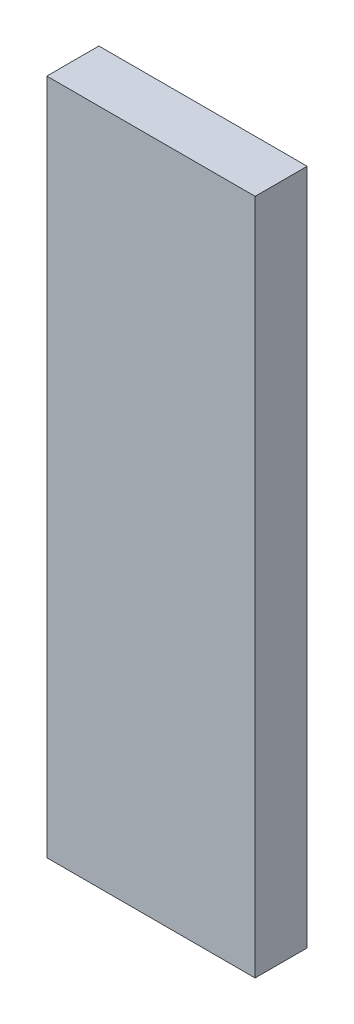
ISO-10303-21;
HEADER;
FILE_DESCRIPTION(('STEP AP214'),'2;1');
FILE_NAME('part.step','',(''),(''),'','','');
FILE_SCHEMA(('AUTOMOTIVE_DESIGN { 1 0 10303 214 1 1 1 1 }'));
ENDSEC;
DATA;
#1=APPLICATION_CONTEXT('core data for automotive mechanical design processes');
#2=APPLICATION_PROTOCOL_DEFINITION('international standard','automotive_design',2000,#1);
#3=PRODUCT_CONTEXT('',#1,'mechanical');
#4=PRODUCT('Part','Part','',(#3));
#5=PRODUCT_RELATED_PRODUCT_CATEGORY('part','',(#4));
#6=PRODUCT_DEFINITION_FORMATION('','',#4);
#7=PRODUCT_DEFINITION_CONTEXT('part definition',#1,'design');
#8=PRODUCT_DEFINITION('design','',#6,#7);
#9=PRODUCT_DEFINITION_SHAPE('','',#8);
#10=(LENGTH_UNIT() NAMED_UNIT(*) SI_UNIT(.MILLI.,.METRE.));
#11=(NAMED_UNIT(*) PLANE_ANGLE_UNIT() SI_UNIT($,.RADIAN.));
#12=(NAMED_UNIT(*) SI_UNIT($,.STERADIAN.) SOLID_ANGLE_UNIT());
#13=UNCERTAINTY_MEASURE_WITH_UNIT(LENGTH_MEASURE(1.E-05),#10,'distance_accuracy_value','');
#14=(GEOMETRIC_REPRESENTATION_CONTEXT(3) GLOBAL_UNCERTAINTY_ASSIGNED_CONTEXT((#13)) GLOBAL_UNIT_ASSIGNED_CONTEXT((#10,
#11,#12)) REPRESENTATION_CONTEXT('',''));
#15=CARTESIAN_POINT('',(0.,0.,0.));
#16=DIRECTION('',(0.,0.,1.));
#17=DIRECTION('',(1.,0.,0.));
#18=AXIS2_PLACEMENT_3D('',#15,#16,#17);
#19=CARTESIAN_POINT('',(-0.1999996,-0.6499987,0.1));
#20=DIRECTION('',(0.,0.,1.));
#21=DIRECTION('',(1.,0.,0.));
#22=AXIS2_PLACEMENT_3D('',#19,#20,#21);
#23=PLANE('',#22);
#24=DIRECTION('',(1.,0.,0.));
#25=VECTOR('',#24,1.);
#26=CARTESIAN_POINT('',(-0.1999996,0.65000124,0.1));
#27=LINE('',#26,#25);
#28=CARTESIAN_POINT('',(-0.1999996,0.65000124,0.1));
#29=VERTEX_POINT('',#28);
#30=CARTESIAN_POINT('',(0.20000214,0.65000124,0.1));
#31=VERTEX_POINT('',#30);
#32=EDGE_CURVE('E52',#29,#31,#27,.T.);
#33=ORIENTED_EDGE('',*,*,#32,.F.);
#34=DIRECTION('',(0.,1.,0.));
#35=VECTOR('',#34,1.);
#36=CARTESIAN_POINT('',(-0.1999996,-0.6499987,0.1));
#37=LINE('',#36,#35);
#38=CARTESIAN_POINT('',(-0.1999996,-0.6499987,0.1));
#39=VERTEX_POINT('',#38);
#40=EDGE_CURVE('E67',#39,#29,#37,.T.);
#41=ORIENTED_EDGE('',*,*,#40,.F.);
#42=DIRECTION('',(1.,0.,0.));
#43=VECTOR('',#42,1.);
#44=CARTESIAN_POINT('',(0.20000214,-0.6499987,0.1));
#45=LINE('',#44,#43);
#46=CARTESIAN_POINT('',(0.20000214,-0.6499987,0.1));
#47=VERTEX_POINT('',#46);
#48=EDGE_CURVE('E19',#47,#39,#45,.F.);
#49=ORIENTED_EDGE('',*,*,#48,.F.);
#50=DIRECTION('',(0.,1.,0.));
#51=VECTOR('',#50,1.);
#52=CARTESIAN_POINT('',(0.20000214,0.65000124,0.1));
#53=LINE('',#52,#51);
#54=EDGE_CURVE('E57',#31,#47,#53,.F.);
#55=ORIENTED_EDGE('',*,*,#54,.F.);
#56=EDGE_LOOP('',(#33,#41,#49,#55));
#57=FACE_BOUND('',#56,.T.);
#58=ADVANCED_FACE('F16',(#57),#23,.T.);
#59=CARTESIAN_POINT('',(0.20000214,-0.6499987,0.));
#60=DIRECTION('',(0.,-1.,0.));
#61=DIRECTION('',(0.,0.,-1.));
#62=AXIS2_PLACEMENT_3D('',#59,#60,#61);
#63=PLANE('',#62);
#64=DIRECTION('',(0.,0.,1.));
#65=VECTOR('',#64,1.);
#66=CARTESIAN_POINT('',(-0.1999996,-0.6499987,0.));
#67=LINE('',#66,#65);
#68=CARTESIAN_POINT('',(-0.1999996,-0.6499987,0.));
#69=VERTEX_POINT('',#68);
#70=EDGE_CURVE('E78',#69,#39,#67,.T.);
#71=ORIENTED_EDGE('',*,*,#70,.F.);
#72=DIRECTION('',(1.,0.,0.));
#73=VECTOR('',#72,1.);
#74=CARTESIAN_POINT('',(-0.1999996,-0.6499987,0.));
#75=LINE('',#74,#73);
#76=CARTESIAN_POINT('',(0.20000214,-0.6499987,0.));
#77=VERTEX_POINT('',#76);
#78=EDGE_CURVE('E73',#69,#77,#75,.T.);
#79=ORIENTED_EDGE('',*,*,#78,.T.);
#80=DIRECTION('',(0.,0.,-1.));
#81=VECTOR('',#80,1.);
#82=CARTESIAN_POINT('',(0.20000214,-0.6499987,0.));
#83=LINE('',#82,#81);
#84=EDGE_CURVE('E62',#47,#77,#83,.T.);
#85=ORIENTED_EDGE('',*,*,#84,.F.);
#86=ORIENTED_EDGE('',*,*,#48,.T.);
#87=EDGE_LOOP('',(#71,#79,#85,#86));
#88=FACE_BOUND('',#87,.T.);
#89=ADVANCED_FACE('F72',(#88),#63,.T.);
#90=CARTESIAN_POINT('',(0.20000214,0.65000124,0.));
#91=DIRECTION('',(1.,0.,0.));
#92=DIRECTION('',(0.,0.,-1.));
#93=AXIS2_PLACEMENT_3D('',#90,#91,#92);
#94=PLANE('',#93);
#95=ORIENTED_EDGE('',*,*,#84,.T.);
#96=DIRECTION('',(0.,1.,0.));
#97=VECTOR('',#96,1.);
#98=CARTESIAN_POINT('',(0.20000214,-0.6499987,0.));
#99=LINE('',#98,#97);
#100=CARTESIAN_POINT('',(0.20000214,0.65000124,0.));
#101=VERTEX_POINT('',#100);
#102=EDGE_CURVE('E83',#77,#101,#99,.T.);
#103=ORIENTED_EDGE('',*,*,#102,.T.);
#104=DIRECTION('',(0.,0.,1.));
#105=VECTOR('',#104,1.);
#106=CARTESIAN_POINT('',(0.20000214,0.65000124,0.));
#107=LINE('',#106,#105);
#108=EDGE_CURVE('E64',#31,#101,#107,.F.);
#109=ORIENTED_EDGE('',*,*,#108,.F.);
#110=ORIENTED_EDGE('',*,*,#54,.T.);
#111=EDGE_LOOP('',(#95,#103,#109,#110));
#112=FACE_BOUND('',#111,.T.);
#113=ADVANCED_FACE('F59',(#112),#94,.T.);
#114=CARTESIAN_POINT('',(-0.1999996,0.65000124,0.));
#115=DIRECTION('',(0.,1.,0.));
#116=DIRECTION('',(0.,0.,1.));
#117=AXIS2_PLACEMENT_3D('',#114,#115,#116);
#118=PLANE('',#117);
#119=ORIENTED_EDGE('',*,*,#108,.T.);
#120=DIRECTION('',(1.,0.,0.));
#121=VECTOR('',#120,1.);
#122=CARTESIAN_POINT('',(-0.1999996,0.65000124,0.));
#123=LINE('',#122,#121);
#124=CARTESIAN_POINT('',(-0.1999996,0.65000124,0.));
#125=VERTEX_POINT('',#124);
#126=EDGE_CURVE('E25',#101,#125,#123,.F.);
#127=ORIENTED_EDGE('',*,*,#126,.T.);
#128=DIRECTION('',(0.,0.,1.));
#129=VECTOR('',#128,1.);
#130=CARTESIAN_POINT('',(-0.1999996,0.65000124,0.));
#131=LINE('',#130,#129);
#132=EDGE_CURVE('E33',#29,#125,#131,.F.);
#133=ORIENTED_EDGE('',*,*,#132,.F.);
#134=ORIENTED_EDGE('',*,*,#32,.T.);
#135=EDGE_LOOP('',(#119,#127,#133,#134));
#136=FACE_BOUND('',#135,.T.);
#137=ADVANCED_FACE('F87',(#136),#118,.T.);
#138=CARTESIAN_POINT('',(-0.1999996,-0.6499987,0.));
#139=DIRECTION('',(-1.,0.,0.));
#140=DIRECTION('',(0.,0.,1.));
#141=AXIS2_PLACEMENT_3D('',#138,#139,#140);
#142=PLANE('',#141);
#143=ORIENTED_EDGE('',*,*,#132,.T.);
#144=DIRECTION('',(0.,1.,0.));
#145=VECTOR('',#144,1.);
#146=CARTESIAN_POINT('',(-0.1999996,-0.6499987,0.));
#147=LINE('',#146,#145);
#148=EDGE_CURVE('E11',#125,#69,#147,.F.);
#149=ORIENTED_EDGE('',*,*,#148,.T.);
#150=ORIENTED_EDGE('',*,*,#70,.T.);
#151=ORIENTED_EDGE('',*,*,#40,.T.);
#152=EDGE_LOOP('',(#143,#149,#150,#151));
#153=FACE_BOUND('',#152,.T.);
#154=ADVANCED_FACE('F90',(#153),#142,.T.);
#155=CARTESIAN_POINT('',(-0.1999996,-0.6499987,0.));
#156=DIRECTION('',(0.,0.,1.));
#157=DIRECTION('',(1.,0.,0.));
#158=AXIS2_PLACEMENT_3D('',#155,#156,#157);
#159=PLANE('',#158);
#160=ORIENTED_EDGE('',*,*,#126,.F.);
#161=ORIENTED_EDGE('',*,*,#102,.F.);
#162=ORIENTED_EDGE('',*,*,#78,.F.);
#163=ORIENTED_EDGE('',*,*,#148,.F.);
#164=EDGE_LOOP('',(#160,#161,#162,#163));
#165=FACE_BOUND('',#164,.T.);
#166=ADVANCED_FACE('F89',(#165),#159,.F.);
#167=CLOSED_SHELL('',(#58,#89,#113,#137,#154,#166));
#168=MANIFOLD_SOLID_BREP('B1',#167);
#169=ADVANCED_BREP_SHAPE_REPRESENTATION('',(#18,#168),#14);
#170=SHAPE_DEFINITION_REPRESENTATION(#9,#169);
ENDSEC;
END-ISO-10303-21;
